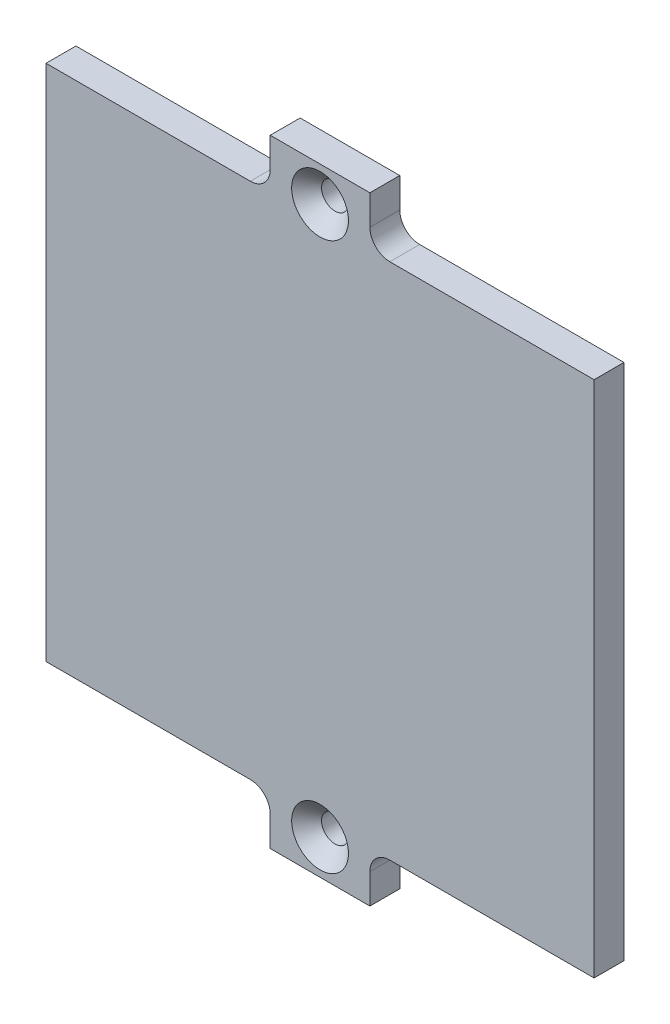
ISO-10303-21;
HEADER;
FILE_DESCRIPTION(('STEP AP214'),'2;1');
FILE_NAME('part.step','',(''),(''),'','','');
FILE_SCHEMA(('AUTOMOTIVE_DESIGN { 1 0 10303 214 1 1 1 1 }'));
ENDSEC;
DATA;
#1=APPLICATION_CONTEXT('core data for automotive mechanical design processes');
#2=APPLICATION_PROTOCOL_DEFINITION('international standard','automotive_design',2000,#1);
#3=PRODUCT_CONTEXT('',#1,'mechanical');
#4=PRODUCT('Part','Part','',(#3));
#5=PRODUCT_RELATED_PRODUCT_CATEGORY('part','',(#4));
#6=PRODUCT_DEFINITION_FORMATION('','',#4);
#7=PRODUCT_DEFINITION_CONTEXT('part definition',#1,'design');
#8=PRODUCT_DEFINITION('design','',#6,#7);
#9=PRODUCT_DEFINITION_SHAPE('','',#8);
#10=(LENGTH_UNIT() NAMED_UNIT(*) SI_UNIT(.MILLI.,.METRE.));
#11=(NAMED_UNIT(*) PLANE_ANGLE_UNIT() SI_UNIT($,.RADIAN.));
#12=(NAMED_UNIT(*) SI_UNIT($,.STERADIAN.) SOLID_ANGLE_UNIT());
#13=UNCERTAINTY_MEASURE_WITH_UNIT(LENGTH_MEASURE(1.E-05),#10,'distance_accuracy_value','');
#14=(GEOMETRIC_REPRESENTATION_CONTEXT(3) GLOBAL_UNCERTAINTY_ASSIGNED_CONTEXT((#13)) GLOBAL_UNIT_ASSIGNED_CONTEXT((#10,
#11,#12)) REPRESENTATION_CONTEXT('',''));
#15=CARTESIAN_POINT('',(0.,0.,0.));
#16=DIRECTION('',(0.,0.,1.));
#17=DIRECTION('',(1.,0.,0.));
#18=AXIS2_PLACEMENT_3D('',#15,#16,#17);
#19=CARTESIAN_POINT('',(68.8,0.,3.));
#20=DIRECTION('',(-1.,0.,0.));
#21=DIRECTION('',(0.,0.,1.));
#22=AXIS2_PLACEMENT_3D('',#19,#20,#21);
#23=PLANE('',#22);
#24=DIRECTION('',(0.,1.,0.));
#25=VECTOR('',#24,1.);
#26=CARTESIAN_POINT('',(68.8,0.,0.));
#27=LINE('',#26,#25);
#28=CARTESIAN_POINT('',(68.8,-26.1499999999999,0.));
#29=VERTEX_POINT('',#28);
#30=CARTESIAN_POINT('',(68.8,25.8500000000001,0.));
#31=VERTEX_POINT('',#30);
#32=EDGE_CURVE('E183',#29,#31,#27,.T.);
#33=ORIENTED_EDGE('',*,*,#32,.T.);
#34=DIRECTION('',(0.,0.,-1.));
#35=VECTOR('',#34,1.);
#36=CARTESIAN_POINT('',(68.8,25.8500000000001,3.));
#37=LINE('',#36,#35);
#38=CARTESIAN_POINT('',(68.8,25.8500000000001,3.));
#39=VERTEX_POINT('',#38);
#40=EDGE_CURVE('E257',#39,#31,#37,.T.);
#41=ORIENTED_EDGE('',*,*,#40,.F.);
#42=DIRECTION('',(0.,1.,0.));
#43=VECTOR('',#42,1.);
#44=CARTESIAN_POINT('',(68.8,0.,3.));
#45=LINE('',#44,#43);
#46=CARTESIAN_POINT('',(68.8,-26.1499999999999,3.));
#47=VERTEX_POINT('',#46);
#48=EDGE_CURVE('E226',#47,#39,#45,.T.);
#49=ORIENTED_EDGE('',*,*,#48,.F.);
#50=DIRECTION('',(0.,0.,-1.));
#51=VECTOR('',#50,1.);
#52=CARTESIAN_POINT('',(68.8,-26.1499999999999,3.));
#53=LINE('',#52,#51);
#54=EDGE_CURVE('E179',#47,#29,#53,.T.);
#55=ORIENTED_EDGE('',*,*,#54,.T.);
#56=EDGE_LOOP('',(#33,#41,#49,#55));
#57=FACE_BOUND('',#56,.T.);
#58=ADVANCED_FACE('F37',(#57),#23,.F.);
#59=CARTESIAN_POINT('',(0.,25.8500000000001,3.));
#60=DIRECTION('',(0.,-1.,0.));
#61=DIRECTION('',(0.,0.,-1.));
#62=AXIS2_PLACEMENT_3D('',#59,#60,#61);
#63=PLANE('',#62);
#64=DIRECTION('',(-1.,0.,0.));
#65=VECTOR('',#64,1.);
#66=CARTESIAN_POINT('',(0.,25.8500000000001,0.));
#67=LINE('',#66,#65);
#68=CARTESIAN_POINT('',(48.3,25.8500000000001,0.));
#69=VERTEX_POINT('',#68);
#70=EDGE_CURVE('E186',#31,#69,#67,.T.);
#71=ORIENTED_EDGE('',*,*,#70,.T.);
#72=DIRECTION('',(0.,0.,-1.));
#73=VECTOR('',#72,1.);
#74=CARTESIAN_POINT('',(48.3,25.8500000000001,3.));
#75=LINE('',#74,#73);
#76=CARTESIAN_POINT('',(48.3,25.8500000000001,3.));
#77=VERTEX_POINT('',#76);
#78=EDGE_CURVE('E255',#77,#69,#75,.T.);
#79=ORIENTED_EDGE('',*,*,#78,.F.);
#80=DIRECTION('',(-1.,0.,0.));
#81=VECTOR('',#80,1.);
#82=CARTESIAN_POINT('',(0.,25.8500000000001,3.));
#83=LINE('',#82,#81);
#84=EDGE_CURVE('E119',#39,#77,#83,.T.);
#85=ORIENTED_EDGE('',*,*,#84,.F.);
#86=ORIENTED_EDGE('',*,*,#40,.T.);
#87=EDGE_LOOP('',(#71,#79,#85,#86));
#88=FACE_BOUND('',#87,.T.);
#89=ADVANCED_FACE('F292',(#88),#63,.F.);
#90=CARTESIAN_POINT('',(48.3,27.8500000000001,3.));
#91=DIRECTION('',(0.,0.,-1.));
#92=DIRECTION('',(-1.,0.,0.));
#93=AXIS2_PLACEMENT_3D('',#90,#91,#92);
#94=CYLINDRICAL_SURFACE('',#93,2.);
#95=CARTESIAN_POINT('',(48.3,27.8500000000001,0.));
#96=DIRECTION('',(0.,0.,1.));
#97=DIRECTION('',(1.,0.,0.));
#98=AXIS2_PLACEMENT_3D('',#95,#96,#97);
#99=CIRCLE('',#98,2.);
#100=CARTESIAN_POINT('',(46.3,27.8500000000001,0.));
#101=VERTEX_POINT('',#100);
#102=EDGE_CURVE('E189',#101,#69,#99,.T.);
#103=ORIENTED_EDGE('',*,*,#102,.F.);
#104=DIRECTION('',(0.,0.,-1.));
#105=VECTOR('',#104,1.);
#106=CARTESIAN_POINT('',(46.3,27.8500000000001,3.));
#107=LINE('',#106,#105);
#108=CARTESIAN_POINT('',(46.3,27.8500000000001,3.));
#109=VERTEX_POINT('',#108);
#110=EDGE_CURVE('E253',#109,#101,#107,.T.);
#111=ORIENTED_EDGE('',*,*,#110,.F.);
#112=CARTESIAN_POINT('',(48.3,27.8500000000001,3.));
#113=DIRECTION('',(0.,0.,1.));
#114=DIRECTION('',(1.,0.,0.));
#115=AXIS2_PLACEMENT_3D('',#112,#113,#114);
#116=CIRCLE('',#115,2.);
#117=EDGE_CURVE('E511',#109,#77,#116,.T.);
#118=ORIENTED_EDGE('',*,*,#117,.T.);
#119=ORIENTED_EDGE('',*,*,#78,.T.);
#120=EDGE_LOOP('',(#103,#111,#118,#119));
#121=FACE_BOUND('',#120,.T.);
#122=ADVANCED_FACE('F298',(#121),#94,.F.);
#123=CARTESIAN_POINT('',(46.3,0.,3.));
#124=DIRECTION('',(-1.,0.,0.));
#125=DIRECTION('',(0.,0.,1.));
#126=AXIS2_PLACEMENT_3D('',#123,#124,#125);
#127=PLANE('',#126);
#128=DIRECTION('',(0.,1.,0.));
#129=VECTOR('',#128,1.);
#130=CARTESIAN_POINT('',(46.3,0.,0.));
#131=LINE('',#130,#129);
#132=CARTESIAN_POINT('',(46.3,30.8449153498036,0.));
#133=VERTEX_POINT('',#132);
#134=EDGE_CURVE('E192',#101,#133,#131,.T.);
#135=ORIENTED_EDGE('',*,*,#134,.T.);
#136=DIRECTION('',(0.,0.,-1.));
#137=VECTOR('',#136,1.);
#138=CARTESIAN_POINT('',(46.3,30.8449153498036,3.));
#139=LINE('',#138,#137);
#140=CARTESIAN_POINT('',(46.3,30.8449153498036,3.));
#141=VERTEX_POINT('',#140);
#142=EDGE_CURVE('E250',#141,#133,#139,.T.);
#143=ORIENTED_EDGE('',*,*,#142,.F.);
#144=DIRECTION('',(0.,1.,0.));
#145=VECTOR('',#144,1.);
#146=CARTESIAN_POINT('',(46.3,0.,3.));
#147=LINE('',#146,#145);
#148=EDGE_CURVE('E516',#109,#141,#147,.T.);
#149=ORIENTED_EDGE('',*,*,#148,.F.);
#150=ORIENTED_EDGE('',*,*,#110,.T.);
#151=EDGE_LOOP('',(#135,#143,#149,#150));
#152=FACE_BOUND('',#151,.T.);
#153=ADVANCED_FACE('F308',(#152),#127,.F.);
#154=CARTESIAN_POINT('',(0.,30.8449153498036,3.));
#155=DIRECTION('',(0.,-1.,0.));
#156=DIRECTION('',(0.,0.,-1.));
#157=AXIS2_PLACEMENT_3D('',#154,#155,#156);
#158=PLANE('',#157);
#159=DIRECTION('',(-1.,0.,0.));
#160=VECTOR('',#159,1.);
#161=CARTESIAN_POINT('',(0.,30.8449153498036,0.));
#162=LINE('',#161,#160);
#163=CARTESIAN_POINT('',(36.3,30.8449153498036,0.));
#164=VERTEX_POINT('',#163);
#165=EDGE_CURVE('E194',#133,#164,#162,.T.);
#166=ORIENTED_EDGE('',*,*,#165,.T.);
#167=DIRECTION('',(0.,0.,-1.));
#168=VECTOR('',#167,1.);
#169=CARTESIAN_POINT('',(36.3,30.8449153498036,3.));
#170=LINE('',#169,#168);
#171=CARTESIAN_POINT('',(36.3,30.8449153498036,3.));
#172=VERTEX_POINT('',#171);
#173=EDGE_CURVE('E247',#172,#164,#170,.T.);
#174=ORIENTED_EDGE('',*,*,#173,.F.);
#175=DIRECTION('',(-1.,0.,0.));
#176=VECTOR('',#175,1.);
#177=CARTESIAN_POINT('',(0.,30.8449153498036,3.));
#178=LINE('',#177,#176);
#179=EDGE_CURVE('E518',#141,#172,#178,.T.);
#180=ORIENTED_EDGE('',*,*,#179,.F.);
#181=ORIENTED_EDGE('',*,*,#142,.T.);
#182=EDGE_LOOP('',(#166,#174,#180,#181));
#183=FACE_BOUND('',#182,.T.);
#184=ADVANCED_FACE('F312',(#183),#158,.F.);
#185=CARTESIAN_POINT('',(36.3,0.,3.));
#186=DIRECTION('',(1.,0.,0.));
#187=DIRECTION('',(0.,0.,-1.));
#188=AXIS2_PLACEMENT_3D('',#185,#186,#187);
#189=PLANE('',#188);
#190=DIRECTION('',(0.,-1.,0.));
#191=VECTOR('',#190,1.);
#192=CARTESIAN_POINT('',(36.3,0.,0.));
#193=LINE('',#192,#191);
#194=CARTESIAN_POINT('',(36.3,27.8500000000001,0.));
#195=VERTEX_POINT('',#194);
#196=EDGE_CURVE('E196',#164,#195,#193,.T.);
#197=ORIENTED_EDGE('',*,*,#196,.T.);
#198=DIRECTION('',(0.,0.,-1.));
#199=VECTOR('',#198,1.);
#200=CARTESIAN_POINT('',(36.3,27.8500000000001,3.));
#201=LINE('',#200,#199);
#202=CARTESIAN_POINT('',(36.3,27.8500000000001,3.));
#203=VERTEX_POINT('',#202);
#204=EDGE_CURVE('E245',#203,#195,#201,.T.);
#205=ORIENTED_EDGE('',*,*,#204,.F.);
#206=DIRECTION('',(0.,-1.,0.));
#207=VECTOR('',#206,1.);
#208=CARTESIAN_POINT('',(36.3,0.,3.));
#209=LINE('',#208,#207);
#210=EDGE_CURVE('E520',#172,#203,#209,.T.);
#211=ORIENTED_EDGE('',*,*,#210,.F.);
#212=ORIENTED_EDGE('',*,*,#173,.T.);
#213=EDGE_LOOP('',(#197,#205,#211,#212));
#214=FACE_BOUND('',#213,.T.);
#215=ADVANCED_FACE('F316',(#214),#189,.F.);
#216=CARTESIAN_POINT('',(34.3,27.8500000000001,3.));
#217=DIRECTION('',(0.,0.,-1.));
#218=DIRECTION('',(-1.,0.,0.));
#219=AXIS2_PLACEMENT_3D('',#216,#217,#218);
#220=CYLINDRICAL_SURFACE('',#219,2.);
#221=CARTESIAN_POINT('',(34.3,27.8500000000001,0.));
#222=DIRECTION('',(0.,0.,1.));
#223=DIRECTION('',(1.,0.,0.));
#224=AXIS2_PLACEMENT_3D('',#221,#222,#223);
#225=CIRCLE('',#224,2.);
#226=CARTESIAN_POINT('',(34.3,25.8500000000001,0.));
#227=VERTEX_POINT('',#226);
#228=EDGE_CURVE('E199',#227,#195,#225,.T.);
#229=ORIENTED_EDGE('',*,*,#228,.F.);
#230=DIRECTION('',(0.,0.,-1.));
#231=VECTOR('',#230,1.);
#232=CARTESIAN_POINT('',(34.3,25.8500000000001,3.));
#233=LINE('',#232,#231);
#234=CARTESIAN_POINT('',(34.3,25.8500000000001,3.));
#235=VERTEX_POINT('',#234);
#236=EDGE_CURVE('E243',#235,#227,#233,.T.);
#237=ORIENTED_EDGE('',*,*,#236,.F.);
#238=CARTESIAN_POINT('',(34.3,27.8500000000001,3.));
#239=DIRECTION('',(0.,0.,1.));
#240=DIRECTION('',(1.,0.,0.));
#241=AXIS2_PLACEMENT_3D('',#238,#239,#240);
#242=CIRCLE('',#241,2.);
#243=EDGE_CURVE('E522',#235,#203,#242,.T.);
#244=ORIENTED_EDGE('',*,*,#243,.T.);
#245=ORIENTED_EDGE('',*,*,#204,.T.);
#246=EDGE_LOOP('',(#229,#237,#244,#245));
#247=FACE_BOUND('',#246,.T.);
#248=ADVANCED_FACE('F320',(#247),#220,.F.);
#249=CARTESIAN_POINT('',(0.,25.8500000000001,3.));
#250=DIRECTION('',(0.,-1.,0.));
#251=DIRECTION('',(0.,0.,-1.));
#252=AXIS2_PLACEMENT_3D('',#249,#250,#251);
#253=PLANE('',#252);
#254=DIRECTION('',(-1.,0.,0.));
#255=VECTOR('',#254,1.);
#256=CARTESIAN_POINT('',(0.,25.8500000000001,0.));
#257=LINE('',#256,#255);
#258=CARTESIAN_POINT('',(13.8,25.8500000000001,0.));
#259=VERTEX_POINT('',#258);
#260=EDGE_CURVE('E202',#227,#259,#257,.T.);
#261=ORIENTED_EDGE('',*,*,#260,.T.);
#262=DIRECTION('',(0.,0.,-1.));
#263=VECTOR('',#262,1.);
#264=CARTESIAN_POINT('',(13.8,25.8500000000001,3.));
#265=LINE('',#264,#263);
#266=CARTESIAN_POINT('',(13.8,25.8500000000001,3.));
#267=VERTEX_POINT('',#266);
#268=EDGE_CURVE('E240',#267,#259,#265,.T.);
#269=ORIENTED_EDGE('',*,*,#268,.F.);
#270=DIRECTION('',(-1.,0.,0.));
#271=VECTOR('',#270,1.);
#272=CARTESIAN_POINT('',(0.,25.8500000000001,3.));
#273=LINE('',#272,#271);
#274=EDGE_CURVE('E525',#235,#267,#273,.T.);
#275=ORIENTED_EDGE('',*,*,#274,.F.);
#276=ORIENTED_EDGE('',*,*,#236,.T.);
#277=EDGE_LOOP('',(#261,#269,#275,#276));
#278=FACE_BOUND('',#277,.T.);
#279=ADVANCED_FACE('F324',(#278),#253,.F.);
#280=CARTESIAN_POINT('',(13.8,0.,3.));
#281=DIRECTION('',(1.,0.,0.));
#282=DIRECTION('',(0.,0.,-1.));
#283=AXIS2_PLACEMENT_3D('',#280,#281,#282);
#284=PLANE('',#283);
#285=DIRECTION('',(0.,-1.,0.));
#286=VECTOR('',#285,1.);
#287=CARTESIAN_POINT('',(13.8,0.,0.));
#288=LINE('',#287,#286);
#289=CARTESIAN_POINT('',(13.8,-26.1499999999999,0.));
#290=VERTEX_POINT('',#289);
#291=EDGE_CURVE('E204',#259,#290,#288,.T.);
#292=ORIENTED_EDGE('',*,*,#291,.T.);
#293=DIRECTION('',(0.,0.,-1.));
#294=VECTOR('',#293,1.);
#295=CARTESIAN_POINT('',(13.8,-26.1499999999999,3.));
#296=LINE('',#295,#294);
#297=CARTESIAN_POINT('',(13.8,-26.1499999999999,3.));
#298=VERTEX_POINT('',#297);
#299=EDGE_CURVE('E237',#298,#290,#296,.T.);
#300=ORIENTED_EDGE('',*,*,#299,.F.);
#301=DIRECTION('',(0.,-1.,0.));
#302=VECTOR('',#301,1.);
#303=CARTESIAN_POINT('',(13.8,0.,3.));
#304=LINE('',#303,#302);
#305=EDGE_CURVE('E527',#267,#298,#304,.T.);
#306=ORIENTED_EDGE('',*,*,#305,.F.);
#307=ORIENTED_EDGE('',*,*,#268,.T.);
#308=EDGE_LOOP('',(#292,#300,#306,#307));
#309=FACE_BOUND('',#308,.T.);
#310=ADVANCED_FACE('F328',(#309),#284,.F.);
#311=CARTESIAN_POINT('',(0.,-26.1499999999999,3.));
#312=DIRECTION('',(0.,1.,0.));
#313=DIRECTION('',(-1.,0.,0.));
#314=AXIS2_PLACEMENT_3D('',#311,#312,#313);
#315=PLANE('',#314);
#316=DIRECTION('',(1.,0.,0.));
#317=VECTOR('',#316,1.);
#318=CARTESIAN_POINT('',(0.,-26.1499999999999,0.));
#319=LINE('',#318,#317);
#320=CARTESIAN_POINT('',(34.3,-26.1499999999999,0.));
#321=VERTEX_POINT('',#320);
#322=EDGE_CURVE('E206',#290,#321,#319,.T.);
#323=ORIENTED_EDGE('',*,*,#322,.T.);
#324=DIRECTION('',(0.,0.,-1.));
#325=VECTOR('',#324,1.);
#326=CARTESIAN_POINT('',(34.3,-26.1499999999999,3.));
#327=LINE('',#326,#325);
#328=CARTESIAN_POINT('',(34.3,-26.1499999999999,3.));
#329=VERTEX_POINT('',#328);
#330=EDGE_CURVE('E235',#329,#321,#327,.T.);
#331=ORIENTED_EDGE('',*,*,#330,.F.);
#332=DIRECTION('',(1.,0.,0.));
#333=VECTOR('',#332,1.);
#334=CARTESIAN_POINT('',(0.,-26.1499999999999,3.));
#335=LINE('',#334,#333);
#336=EDGE_CURVE('E529',#298,#329,#335,.T.);
#337=ORIENTED_EDGE('',*,*,#336,.F.);
#338=ORIENTED_EDGE('',*,*,#299,.T.);
#339=EDGE_LOOP('',(#323,#331,#337,#338));
#340=FACE_BOUND('',#339,.T.);
#341=ADVANCED_FACE('F332',(#340),#315,.F.);
#342=CARTESIAN_POINT('',(34.3,-28.1499999999999,3.));
#343=DIRECTION('',(0.,0.,-1.));
#344=DIRECTION('',(-1.,0.,0.));
#345=AXIS2_PLACEMENT_3D('',#342,#343,#344);
#346=CYLINDRICAL_SURFACE('',#345,2.);
#347=CARTESIAN_POINT('',(34.3,-28.1499999999999,0.));
#348=DIRECTION('',(0.,0.,1.));
#349=DIRECTION('',(1.,0.,0.));
#350=AXIS2_PLACEMENT_3D('',#347,#348,#349);
#351=CIRCLE('',#350,2.);
#352=CARTESIAN_POINT('',(36.3,-28.1499999999999,0.));
#353=VERTEX_POINT('',#352);
#354=EDGE_CURVE('E209',#353,#321,#351,.T.);
#355=ORIENTED_EDGE('',*,*,#354,.F.);
#356=DIRECTION('',(0.,0.,-1.));
#357=VECTOR('',#356,1.);
#358=CARTESIAN_POINT('',(36.3,-28.1499999999999,3.));
#359=LINE('',#358,#357);
#360=CARTESIAN_POINT('',(36.3,-28.1499999999999,3.));
#361=VERTEX_POINT('',#360);
#362=EDGE_CURVE('E233',#361,#353,#359,.T.);
#363=ORIENTED_EDGE('',*,*,#362,.F.);
#364=CARTESIAN_POINT('',(34.3,-28.1499999999999,3.));
#365=DIRECTION('',(0.,0.,1.));
#366=DIRECTION('',(1.,0.,0.));
#367=AXIS2_PLACEMENT_3D('',#364,#365,#366);
#368=CIRCLE('',#367,2.);
#369=EDGE_CURVE('E531',#361,#329,#368,.T.);
#370=ORIENTED_EDGE('',*,*,#369,.T.);
#371=ORIENTED_EDGE('',*,*,#330,.T.);
#372=EDGE_LOOP('',(#355,#363,#370,#371));
#373=FACE_BOUND('',#372,.T.);
#374=ADVANCED_FACE('F336',(#373),#346,.F.);
#375=CARTESIAN_POINT('',(36.3,0.,3.));
#376=DIRECTION('',(1.,0.,0.));
#377=DIRECTION('',(0.,0.,-1.));
#378=AXIS2_PLACEMENT_3D('',#375,#376,#377);
#379=PLANE('',#378);
#380=DIRECTION('',(0.,-1.,0.));
#381=VECTOR('',#380,1.);
#382=CARTESIAN_POINT('',(36.3,0.,0.));
#383=LINE('',#382,#381);
#384=CARTESIAN_POINT('',(36.3,-31.1499999999999,0.));
#385=VERTEX_POINT('',#384);
#386=EDGE_CURVE('E212',#353,#385,#383,.T.);
#387=ORIENTED_EDGE('',*,*,#386,.T.);
#388=DIRECTION('',(0.,0.,-1.));
#389=VECTOR('',#388,1.);
#390=CARTESIAN_POINT('',(36.3,-31.1499999999999,3.));
#391=LINE('',#390,#389);
#392=CARTESIAN_POINT('',(36.3,-31.1499999999999,3.));
#393=VERTEX_POINT('',#392);
#394=EDGE_CURVE('E230',#393,#385,#391,.T.);
#395=ORIENTED_EDGE('',*,*,#394,.F.);
#396=DIRECTION('',(0.,-1.,0.));
#397=VECTOR('',#396,1.);
#398=CARTESIAN_POINT('',(36.3,0.,3.));
#399=LINE('',#398,#397);
#400=EDGE_CURVE('E534',#361,#393,#399,.T.);
#401=ORIENTED_EDGE('',*,*,#400,.F.);
#402=ORIENTED_EDGE('',*,*,#362,.T.);
#403=EDGE_LOOP('',(#387,#395,#401,#402));
#404=FACE_BOUND('',#403,.T.);
#405=ADVANCED_FACE('F340',(#404),#379,.F.);
#406=CARTESIAN_POINT('',(0.,-31.1499999999999,3.));
#407=DIRECTION('',(0.,1.,0.));
#408=DIRECTION('',(0.,0.,1.));
#409=AXIS2_PLACEMENT_3D('',#406,#407,#408);
#410=PLANE('',#409);
#411=DIRECTION('',(1.,0.,0.));
#412=VECTOR('',#411,1.);
#413=CARTESIAN_POINT('',(0.,-31.1499999999999,0.));
#414=LINE('',#413,#412);
#415=CARTESIAN_POINT('',(46.3,-31.1499999999999,0.));
#416=VERTEX_POINT('',#415);
#417=EDGE_CURVE('E214',#385,#416,#414,.T.);
#418=ORIENTED_EDGE('',*,*,#417,.T.);
#419=DIRECTION('',(0.,0.,-1.));
#420=VECTOR('',#419,1.);
#421=CARTESIAN_POINT('',(46.3,-31.1499999999999,3.));
#422=LINE('',#421,#420);
#423=CARTESIAN_POINT('',(46.3,-31.1499999999999,3.));
#424=VERTEX_POINT('',#423);
#425=EDGE_CURVE('E175',#424,#416,#422,.T.);
#426=ORIENTED_EDGE('',*,*,#425,.F.);
#427=DIRECTION('',(1.,0.,0.));
#428=VECTOR('',#427,1.);
#429=CARTESIAN_POINT('',(0.,-31.1499999999999,3.));
#430=LINE('',#429,#428);
#431=EDGE_CURVE('E162',#393,#424,#430,.T.);
#432=ORIENTED_EDGE('',*,*,#431,.F.);
#433=ORIENTED_EDGE('',*,*,#394,.T.);
#434=EDGE_LOOP('',(#418,#426,#432,#433));
#435=FACE_BOUND('',#434,.T.);
#436=ADVANCED_FACE('F344',(#435),#410,.F.);
#437=CARTESIAN_POINT('',(46.3,0.,3.));
#438=DIRECTION('',(-1.,0.,0.));
#439=DIRECTION('',(0.,0.,1.));
#440=AXIS2_PLACEMENT_3D('',#437,#438,#439);
#441=PLANE('',#440);
#442=DIRECTION('',(0.,1.,0.));
#443=VECTOR('',#442,1.);
#444=CARTESIAN_POINT('',(46.3,0.,0.));
#445=LINE('',#444,#443);
#446=CARTESIAN_POINT('',(46.3,-28.1499999999999,0.));
#447=VERTEX_POINT('',#446);
#448=EDGE_CURVE('E171',#416,#447,#445,.T.);
#449=ORIENTED_EDGE('',*,*,#448,.T.);
#450=DIRECTION('',(0.,0.,-1.));
#451=VECTOR('',#450,1.);
#452=CARTESIAN_POINT('',(46.3,-28.1499999999999,3.));
#453=LINE('',#452,#451);
#454=CARTESIAN_POINT('',(46.3,-28.1499999999999,3.));
#455=VERTEX_POINT('',#454);
#456=EDGE_CURVE('E168',#455,#447,#453,.T.);
#457=ORIENTED_EDGE('',*,*,#456,.F.);
#458=DIRECTION('',(0.,1.,0.));
#459=VECTOR('',#458,1.);
#460=CARTESIAN_POINT('',(46.3,0.,3.));
#461=LINE('',#460,#459);
#462=EDGE_CURVE('E156',#424,#455,#461,.T.);
#463=ORIENTED_EDGE('',*,*,#462,.F.);
#464=ORIENTED_EDGE('',*,*,#425,.T.);
#465=EDGE_LOOP('',(#449,#457,#463,#464));
#466=FACE_BOUND('',#465,.T.);
#467=ADVANCED_FACE('F169',(#466),#441,.F.);
#468=CARTESIAN_POINT('',(48.3,-28.1499999999999,3.));
#469=DIRECTION('',(0.,0.,-1.));
#470=DIRECTION('',(-1.,0.,0.));
#471=AXIS2_PLACEMENT_3D('',#468,#469,#470);
#472=CYLINDRICAL_SURFACE('',#471,2.);
#473=CARTESIAN_POINT('',(48.3,-28.1499999999999,0.));
#474=DIRECTION('',(0.,0.,1.));
#475=DIRECTION('',(1.,0.,0.));
#476=AXIS2_PLACEMENT_3D('',#473,#474,#475);
#477=CIRCLE('',#476,2.);
#478=CARTESIAN_POINT('',(48.3,-26.1499999999999,0.));
#479=VERTEX_POINT('',#478);
#480=EDGE_CURVE('E217',#479,#447,#477,.T.);
#481=ORIENTED_EDGE('',*,*,#480,.F.);
#482=DIRECTION('',(0.,0.,-1.));
#483=VECTOR('',#482,1.);
#484=CARTESIAN_POINT('',(48.3,-26.1499999999999,3.));
#485=LINE('',#484,#483);
#486=CARTESIAN_POINT('',(48.3,-26.1499999999999,3.));
#487=VERTEX_POINT('',#486);
#488=EDGE_CURVE('E107',#487,#479,#485,.T.);
#489=ORIENTED_EDGE('',*,*,#488,.F.);
#490=CARTESIAN_POINT('',(48.3,-28.1499999999999,3.));
#491=DIRECTION('',(0.,0.,1.));
#492=DIRECTION('',(1.,0.,0.));
#493=AXIS2_PLACEMENT_3D('',#490,#491,#492);
#494=CIRCLE('',#493,2.);
#495=EDGE_CURVE('E160',#487,#455,#494,.T.);
#496=ORIENTED_EDGE('',*,*,#495,.T.);
#497=ORIENTED_EDGE('',*,*,#456,.T.);
#498=EDGE_LOOP('',(#481,#489,#496,#497));
#499=FACE_BOUND('',#498,.T.);
#500=ADVANCED_FACE('F177',(#499),#472,.F.);
#501=CARTESIAN_POINT('',(41.3,-27.6525423250982,3.));
#502=DIRECTION('',(0.,0.,-1.));
#503=DIRECTION('',(-1.,0.,0.));
#504=AXIS2_PLACEMENT_3D('',#501,#502,#503);
#505=CYLINDRICAL_SURFACE('',#504,1.35);
#506=CARTESIAN_POINT('',(41.3,-27.6525423250982,1.5));
#507=DIRECTION('',(0.,0.,1.));
#508=DIRECTION('',(1.,0.,0.));
#509=AXIS2_PLACEMENT_3D('',#506,#507,#508);
#510=CIRCLE('',#509,1.35);
#511=CARTESIAN_POINT('',(42.65,-27.6525423250982,1.5));
#512=VERTEX_POINT('',#511);
#513=EDGE_CURVE('E11',#512,#512,#510,.T.);
#514=ORIENTED_EDGE('',*,*,#513,.T.);
#515=EDGE_LOOP('',(#514));
#516=FACE_BOUND('',#515,.T.);
#517=CARTESIAN_POINT('',(41.3,-27.6525423250982,0.));
#518=DIRECTION('',(0.,0.,1.));
#519=DIRECTION('',(1.,0.,0.));
#520=AXIS2_PLACEMENT_3D('',#517,#518,#519);
#521=CIRCLE('',#520,1.35);
#522=CARTESIAN_POINT('',(42.65,-27.6525423250982,0.));
#523=VERTEX_POINT('',#522);
#524=EDGE_CURVE('E220',#523,#523,#521,.T.);
#525=ORIENTED_EDGE('',*,*,#524,.F.);
#526=EDGE_LOOP('',(#525));
#527=FACE_BOUND('',#526,.T.);
#528=ADVANCED_FACE('F353',(#516,#527),#505,.F.);
#529=CARTESIAN_POINT('',(0.,-26.1499999999999,3.));
#530=DIRECTION('',(0.,1.,0.));
#531=DIRECTION('',(0.,0.,1.));
#532=AXIS2_PLACEMENT_3D('',#529,#530,#531);
#533=PLANE('',#532);
#534=DIRECTION('',(1.,0.,0.));
#535=VECTOR('',#534,1.);
#536=CARTESIAN_POINT('',(0.,-26.1499999999999,0.));
#537=LINE('',#536,#535);
#538=EDGE_CURVE('E110',#479,#29,#537,.T.);
#539=ORIENTED_EDGE('',*,*,#538,.T.);
#540=ORIENTED_EDGE('',*,*,#54,.F.);
#541=DIRECTION('',(1.,0.,0.));
#542=VECTOR('',#541,1.);
#543=CARTESIAN_POINT('',(0.,-26.1499999999999,3.));
#544=LINE('',#543,#542);
#545=EDGE_CURVE('E55',#487,#47,#544,.T.);
#546=ORIENTED_EDGE('',*,*,#545,.F.);
#547=ORIENTED_EDGE('',*,*,#488,.T.);
#548=EDGE_LOOP('',(#539,#540,#546,#547));
#549=FACE_BOUND('',#548,.T.);
#550=ADVANCED_FACE('F278',(#549),#533,.F.);
#551=CARTESIAN_POINT('',(41.3,27.3474576749018,3.));
#552=DIRECTION('',(0.,0.,-1.));
#553=DIRECTION('',(-1.,0.,0.));
#554=AXIS2_PLACEMENT_3D('',#551,#552,#553);
#555=CYLINDRICAL_SURFACE('',#554,1.35);
#556=CARTESIAN_POINT('',(41.3,27.3474576749018,1.5));
#557=DIRECTION('',(0.,0.,1.));
#558=DIRECTION('',(1.,0.,0.));
#559=AXIS2_PLACEMENT_3D('',#556,#557,#558);
#560=CIRCLE('',#559,1.35);
#561=CARTESIAN_POINT('',(42.65,27.3474576749018,1.5));
#562=VERTEX_POINT('',#561);
#563=EDGE_CURVE('E259',#562,#562,#560,.T.);
#564=ORIENTED_EDGE('',*,*,#563,.T.);
#565=EDGE_LOOP('',(#564));
#566=FACE_BOUND('',#565,.T.);
#567=CARTESIAN_POINT('',(41.3,27.3474576749018,0.));
#568=DIRECTION('',(0.,0.,1.));
#569=DIRECTION('',(1.,0.,0.));
#570=AXIS2_PLACEMENT_3D('',#567,#568,#569);
#571=CIRCLE('',#570,1.35);
#572=CARTESIAN_POINT('',(42.65,27.3474576749018,0.));
#573=VERTEX_POINT('',#572);
#574=EDGE_CURVE('E223',#573,#573,#571,.T.);
#575=ORIENTED_EDGE('',*,*,#574,.F.);
#576=EDGE_LOOP('',(#575));
#577=FACE_BOUND('',#576,.T.);
#578=ADVANCED_FACE('F275',(#566,#577),#555,.F.);
#579=CARTESIAN_POINT('',(0.,0.,3.));
#580=DIRECTION('',(0.,0.,1.));
#581=DIRECTION('',(1.,0.,0.));
#582=AXIS2_PLACEMENT_3D('',#579,#580,#581);
#583=PLANE('',#582);
#584=CARTESIAN_POINT('',(41.3,27.3474576749018,3.));
#585=DIRECTION('',(0.,0.,1.));
#586=DIRECTION('',(1.,0.,0.));
#587=AXIS2_PLACEMENT_3D('',#584,#585,#586);
#588=CIRCLE('',#587,2.85000000000001);
#589=CARTESIAN_POINT('',(44.15,27.3474576749018,3.));
#590=VERTEX_POINT('',#589);
#591=EDGE_CURVE('E47',#590,#590,#588,.F.);
#592=ORIENTED_EDGE('',*,*,#591,.T.);
#593=EDGE_LOOP('',(#592));
#594=FACE_BOUND('',#593,.T.);
#595=CARTESIAN_POINT('',(41.3,-27.6525423250982,3.));
#596=DIRECTION('',(0.,0.,1.));
#597=DIRECTION('',(1.,0.,0.));
#598=AXIS2_PLACEMENT_3D('',#595,#596,#597);
#599=CIRCLE('',#598,2.85000000000001);
#600=CARTESIAN_POINT('',(44.15,-27.6525423250982,3.));
#601=VERTEX_POINT('',#600);
#602=EDGE_CURVE('E262',#601,#601,#599,.F.);
#603=ORIENTED_EDGE('',*,*,#602,.T.);
#604=EDGE_LOOP('',(#603));
#605=FACE_BOUND('',#604,.T.);
#606=ORIENTED_EDGE('',*,*,#48,.T.);
#607=ORIENTED_EDGE('',*,*,#84,.T.);
#608=ORIENTED_EDGE('',*,*,#117,.F.);
#609=ORIENTED_EDGE('',*,*,#148,.T.);
#610=ORIENTED_EDGE('',*,*,#179,.T.);
#611=ORIENTED_EDGE('',*,*,#210,.T.);
#612=ORIENTED_EDGE('',*,*,#243,.F.);
#613=ORIENTED_EDGE('',*,*,#274,.T.);
#614=ORIENTED_EDGE('',*,*,#305,.T.);
#615=ORIENTED_EDGE('',*,*,#336,.T.);
#616=ORIENTED_EDGE('',*,*,#369,.F.);
#617=ORIENTED_EDGE('',*,*,#400,.T.);
#618=ORIENTED_EDGE('',*,*,#431,.T.);
#619=ORIENTED_EDGE('',*,*,#462,.T.);
#620=ORIENTED_EDGE('',*,*,#495,.F.);
#621=ORIENTED_EDGE('',*,*,#545,.T.);
#622=EDGE_LOOP('',(#606,#607,#608,#609,#610,#611,#612,#613,#614,#615,#616,#617,#618,#619,#620,#621));
#623=FACE_BOUND('',#622,.T.);
#624=ADVANCED_FACE('F158',(#594,#605,#623),#583,.T.);
#625=CARTESIAN_POINT('',(0.,0.,0.));
#626=DIRECTION('',(0.,0.,1.));
#627=DIRECTION('',(1.,0.,0.));
#628=AXIS2_PLACEMENT_3D('',#625,#626,#627);
#629=PLANE('',#628);
#630=ORIENTED_EDGE('',*,*,#32,.F.);
#631=ORIENTED_EDGE('',*,*,#538,.F.);
#632=ORIENTED_EDGE('',*,*,#480,.T.);
#633=ORIENTED_EDGE('',*,*,#448,.F.);
#634=ORIENTED_EDGE('',*,*,#417,.F.);
#635=ORIENTED_EDGE('',*,*,#386,.F.);
#636=ORIENTED_EDGE('',*,*,#354,.T.);
#637=ORIENTED_EDGE('',*,*,#322,.F.);
#638=ORIENTED_EDGE('',*,*,#291,.F.);
#639=ORIENTED_EDGE('',*,*,#260,.F.);
#640=ORIENTED_EDGE('',*,*,#228,.T.);
#641=ORIENTED_EDGE('',*,*,#196,.F.);
#642=ORIENTED_EDGE('',*,*,#165,.F.);
#643=ORIENTED_EDGE('',*,*,#134,.F.);
#644=ORIENTED_EDGE('',*,*,#102,.T.);
#645=ORIENTED_EDGE('',*,*,#70,.F.);
#646=EDGE_LOOP('',(#630,#631,#632,#633,#634,#635,#636,#637,#638,#639,#640,#641,#642,#643,#644,#645));
#647=FACE_BOUND('',#646,.T.);
#648=ORIENTED_EDGE('',*,*,#524,.T.);
#649=EDGE_LOOP('',(#648));
#650=FACE_BOUND('',#649,.T.);
#651=ORIENTED_EDGE('',*,*,#574,.T.);
#652=EDGE_LOOP('',(#651));
#653=FACE_BOUND('',#652,.T.);
#654=ADVANCED_FACE('F272',(#647,#650,#653),#629,.F.);
#655=CARTESIAN_POINT('',(41.3,27.3474576749018,1.5));
#656=DIRECTION('',(0.,0.,1.));
#657=DIRECTION('',(1.,0.,0.));
#658=AXIS2_PLACEMENT_3D('',#655,#656,#657);
#659=CONICAL_SURFACE('',#658,1.35,0.785398163397451);
#660=ORIENTED_EDGE('',*,*,#591,.F.);
#661=EDGE_LOOP('',(#660));
#662=FACE_BOUND('',#661,.T.);
#663=ORIENTED_EDGE('',*,*,#563,.F.);
#664=EDGE_LOOP('',(#663));
#665=FACE_BOUND('',#664,.T.);
#666=ADVANCED_FACE('F269',(#662,#665),#659,.F.);
#667=CARTESIAN_POINT('',(41.3,-27.6525423250982,1.5));
#668=DIRECTION('',(0.,0.,1.));
#669=DIRECTION('',(1.,0.,0.));
#670=AXIS2_PLACEMENT_3D('',#667,#668,#669);
#671=CONICAL_SURFACE('',#670,1.35,0.785398163397451);
#672=ORIENTED_EDGE('',*,*,#602,.F.);
#673=EDGE_LOOP('',(#672));
#674=FACE_BOUND('',#673,.T.);
#675=ORIENTED_EDGE('',*,*,#513,.F.);
#676=EDGE_LOOP('',(#675));
#677=FACE_BOUND('',#676,.T.);
#678=ADVANCED_FACE('F40',(#674,#677),#671,.F.);
#679=CLOSED_SHELL('',(#58,#89,#122,#153,#184,#215,#248,#279,#310,#341,#374,#405,#436,#467,#500,
#528,#550,#578,#624,#654,#666,#678));
#680=MANIFOLD_SOLID_BREP('B2',#679);
#681=ADVANCED_BREP_SHAPE_REPRESENTATION('',(#18,#680),#14);
#682=SHAPE_DEFINITION_REPRESENTATION(#9,#681);
ENDSEC;
END-ISO-10303-21;
